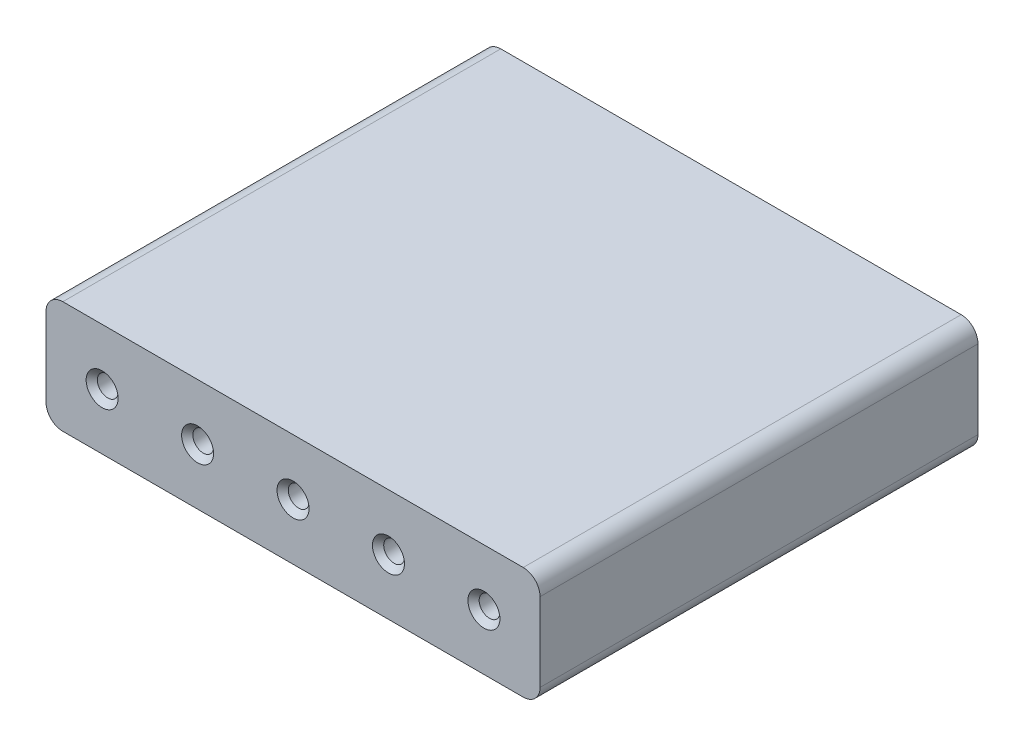
ISO-10303-21;
HEADER;
FILE_DESCRIPTION(('STEP AP214'),'2;1');
FILE_NAME('part.step','',(''),(''),'','','');
FILE_SCHEMA(('AUTOMOTIVE_DESIGN { 1 0 10303 214 1 1 1 1 }'));
ENDSEC;
DATA;
#1=APPLICATION_CONTEXT('core data for automotive mechanical design processes');
#2=APPLICATION_PROTOCOL_DEFINITION('international standard','automotive_design',2000,#1);
#3=PRODUCT_CONTEXT('',#1,'mechanical');
#4=PRODUCT('Part','Part','',(#3));
#5=PRODUCT_RELATED_PRODUCT_CATEGORY('part','',(#4));
#6=PRODUCT_DEFINITION_FORMATION('','',#4);
#7=PRODUCT_DEFINITION_CONTEXT('part definition',#1,'design');
#8=PRODUCT_DEFINITION('design','',#6,#7);
#9=PRODUCT_DEFINITION_SHAPE('','',#8);
#10=(LENGTH_UNIT() NAMED_UNIT(*) SI_UNIT(.MILLI.,.METRE.));
#11=(NAMED_UNIT(*) PLANE_ANGLE_UNIT() SI_UNIT($,.RADIAN.));
#12=(NAMED_UNIT(*) SI_UNIT($,.STERADIAN.) SOLID_ANGLE_UNIT());
#13=UNCERTAINTY_MEASURE_WITH_UNIT(LENGTH_MEASURE(1.E-05),#10,'distance_accuracy_value','');
#14=(GEOMETRIC_REPRESENTATION_CONTEXT(3) GLOBAL_UNCERTAINTY_ASSIGNED_CONTEXT((#13)) GLOBAL_UNIT_ASSIGNED_CONTEXT((#10,
#11,#12)) REPRESENTATION_CONTEXT('',''));
#15=CARTESIAN_POINT('',(0.,0.,0.));
#16=DIRECTION('',(0.,0.,1.));
#17=DIRECTION('',(1.,0.,0.));
#18=AXIS2_PLACEMENT_3D('',#15,#16,#17);
#19=CARTESIAN_POINT('',(41.,7.,78.));
#20=DIRECTION('',(0.,0.,1.));
#21=DIRECTION('',(1.,0.,0.));
#22=AXIS2_PLACEMENT_3D('',#19,#20,#21);
#23=PLANE('',#22);
#24=CARTESIAN_POINT('',(34.,0.,78.));
#25=DIRECTION('',(0.,0.,1.));
#26=DIRECTION('',(1.,0.,0.));
#27=AXIS2_PLACEMENT_3D('',#24,#25,#26);
#28=CIRCLE('',#27,2.84999999999999);
#29=CARTESIAN_POINT('',(36.85,0.,78.));
#30=VERTEX_POINT('',#29);
#31=EDGE_CURVE('E11',#30,#30,#28,.F.);
#32=ORIENTED_EDGE('',*,*,#31,.T.);
#33=EDGE_LOOP('',(#32));
#34=FACE_BOUND('',#33,.T.);
#35=CARTESIAN_POINT('',(0.,0.,78.));
#36=DIRECTION('',(0.,0.,1.));
#37=DIRECTION('',(1.,0.,0.));
#38=AXIS2_PLACEMENT_3D('',#35,#36,#37);
#39=CIRCLE('',#38,2.84999999999999);
#40=CARTESIAN_POINT('',(2.84999999999999,0.,78.));
#41=VERTEX_POINT('',#40);
#42=EDGE_CURVE('E51',#41,#41,#39,.F.);
#43=ORIENTED_EDGE('',*,*,#42,.T.);
#44=EDGE_LOOP('',(#43));
#45=FACE_BOUND('',#44,.T.);
#46=CARTESIAN_POINT('',(-17.,0.,78.));
#47=DIRECTION('',(0.,0.,1.));
#48=DIRECTION('',(1.,0.,0.));
#49=AXIS2_PLACEMENT_3D('',#46,#47,#48);
#50=CIRCLE('',#49,2.84999999999999);
#51=CARTESIAN_POINT('',(-14.15,0.,78.));
#52=VERTEX_POINT('',#51);
#53=EDGE_CURVE('E219',#52,#52,#50,.F.);
#54=ORIENTED_EDGE('',*,*,#53,.T.);
#55=EDGE_LOOP('',(#54));
#56=FACE_BOUND('',#55,.T.);
#57=CARTESIAN_POINT('',(17.,0.,78.));
#58=DIRECTION('',(0.,0.,1.));
#59=DIRECTION('',(1.,0.,0.));
#60=AXIS2_PLACEMENT_3D('',#57,#58,#59);
#61=CIRCLE('',#60,2.84999999999999);
#62=CARTESIAN_POINT('',(19.85,0.,78.));
#63=VERTEX_POINT('',#62);
#64=EDGE_CURVE('E216',#63,#63,#61,.F.);
#65=ORIENTED_EDGE('',*,*,#64,.T.);
#66=EDGE_LOOP('',(#65));
#67=FACE_BOUND('',#66,.T.);
#68=CARTESIAN_POINT('',(-34.,0.,78.));
#69=DIRECTION('',(0.,0.,1.));
#70=DIRECTION('',(1.,0.,0.));
#71=AXIS2_PLACEMENT_3D('',#68,#69,#70);
#72=CIRCLE('',#71,2.84999999999999);
#73=CARTESIAN_POINT('',(-31.15,0.,78.));
#74=VERTEX_POINT('',#73);
#75=EDGE_CURVE('E213',#74,#74,#72,.F.);
#76=ORIENTED_EDGE('',*,*,#75,.T.);
#77=EDGE_LOOP('',(#76));
#78=FACE_BOUND('',#77,.T.);
#79=CARTESIAN_POINT('',(41.,7.,78.));
#80=DIRECTION('',(0.,0.,1.));
#81=DIRECTION('',(1.,0.,0.));
#82=AXIS2_PLACEMENT_3D('',#79,#80,#81);
#83=CIRCLE('',#82,3.);
#84=CARTESIAN_POINT('',(44.,7.,78.));
#85=VERTEX_POINT('',#84);
#86=CARTESIAN_POINT('',(41.,10.,78.));
#87=VERTEX_POINT('',#86);
#88=EDGE_CURVE('E153',#85,#87,#83,.T.);
#89=ORIENTED_EDGE('',*,*,#88,.T.);
#90=DIRECTION('',(-1.,0.,0.));
#91=VECTOR('',#90,1.);
#92=CARTESIAN_POINT('',(41.,10.,78.));
#93=LINE('',#92,#91);
#94=CARTESIAN_POINT('',(-41.,10.,78.));
#95=VERTEX_POINT('',#94);
#96=EDGE_CURVE('E103',#87,#95,#93,.T.);
#97=ORIENTED_EDGE('',*,*,#96,.T.);
#98=CARTESIAN_POINT('',(-41.,7.,78.));
#99=DIRECTION('',(0.,0.,1.));
#100=DIRECTION('',(1.,0.,0.));
#101=AXIS2_PLACEMENT_3D('',#98,#99,#100);
#102=CIRCLE('',#101,3.);
#103=CARTESIAN_POINT('',(-44.,7.,78.));
#104=VERTEX_POINT('',#103);
#105=EDGE_CURVE('E372',#95,#104,#102,.T.);
#106=ORIENTED_EDGE('',*,*,#105,.T.);
#107=DIRECTION('',(0.,-1.,0.));
#108=VECTOR('',#107,1.);
#109=CARTESIAN_POINT('',(-44.,-7.,78.));
#110=LINE('',#109,#108);
#111=CARTESIAN_POINT('',(-44.,-7.,78.));
#112=VERTEX_POINT('',#111);
#113=EDGE_CURVE('E376',#104,#112,#110,.T.);
#114=ORIENTED_EDGE('',*,*,#113,.T.);
#115=CARTESIAN_POINT('',(-41.,-7.,78.));
#116=DIRECTION('',(0.,0.,1.));
#117=DIRECTION('',(-1.,0.,0.));
#118=AXIS2_PLACEMENT_3D('',#115,#116,#117);
#119=CIRCLE('',#118,3.00000000000001);
#120=CARTESIAN_POINT('',(-41.,-10.,78.));
#121=VERTEX_POINT('',#120);
#122=EDGE_CURVE('E121',#112,#121,#119,.T.);
#123=ORIENTED_EDGE('',*,*,#122,.T.);
#124=DIRECTION('',(1.,0.,0.));
#125=VECTOR('',#124,1.);
#126=CARTESIAN_POINT('',(41.,-10.,78.));
#127=LINE('',#126,#125);
#128=CARTESIAN_POINT('',(41.,-10.,78.));
#129=VERTEX_POINT('',#128);
#130=EDGE_CURVE('E116',#121,#129,#127,.T.);
#131=ORIENTED_EDGE('',*,*,#130,.T.);
#132=CARTESIAN_POINT('',(41.,-7.,78.));
#133=DIRECTION('',(0.,0.,1.));
#134=DIRECTION('',(1.,0.,0.));
#135=AXIS2_PLACEMENT_3D('',#132,#133,#134);
#136=CIRCLE('',#135,3.);
#137=CARTESIAN_POINT('',(44.,-7.,78.));
#138=VERTEX_POINT('',#137);
#139=EDGE_CURVE('E119',#129,#138,#136,.T.);
#140=ORIENTED_EDGE('',*,*,#139,.T.);
#141=DIRECTION('',(0.,1.,0.));
#142=VECTOR('',#141,1.);
#143=CARTESIAN_POINT('',(44.,-7.,78.));
#144=LINE('',#143,#142);
#145=EDGE_CURVE('E59',#138,#85,#144,.T.);
#146=ORIENTED_EDGE('',*,*,#145,.T.);
#147=EDGE_LOOP('',(#89,#97,#106,#114,#123,#131,#140,#146));
#148=FACE_BOUND('',#147,.T.);
#149=ADVANCED_FACE('F41',(#34,#45,#56,#67,#78,#148),#23,.T.);
#150=CARTESIAN_POINT('',(41.,7.,0.));
#151=DIRECTION('',(0.,0.,1.));
#152=DIRECTION('',(1.,0.,0.));
#153=AXIS2_PLACEMENT_3D('',#150,#151,#152);
#154=PLANE('',#153);
#155=CARTESIAN_POINT('',(17.,0.,0.));
#156=DIRECTION('',(0.,0.,1.));
#157=DIRECTION('',(1.,0.,0.));
#158=AXIS2_PLACEMENT_3D('',#155,#156,#157);
#159=CIRCLE('',#158,2.85000000000002);
#160=CARTESIAN_POINT('',(19.85,0.,0.));
#161=VERTEX_POINT('',#160);
#162=EDGE_CURVE('E180',#161,#161,#159,.T.);
#163=ORIENTED_EDGE('',*,*,#162,.T.);
#164=EDGE_LOOP('',(#163));
#165=FACE_BOUND('',#164,.T.);
#166=CARTESIAN_POINT('',(0.,0.,0.));
#167=DIRECTION('',(0.,0.,1.));
#168=DIRECTION('',(1.,0.,0.));
#169=AXIS2_PLACEMENT_3D('',#166,#167,#168);
#170=CIRCLE('',#169,2.85000000000002);
#171=CARTESIAN_POINT('',(2.85000000000002,0.,0.));
#172=VERTEX_POINT('',#171);
#173=EDGE_CURVE('E177',#172,#172,#170,.T.);
#174=ORIENTED_EDGE('',*,*,#173,.T.);
#175=EDGE_LOOP('',(#174));
#176=FACE_BOUND('',#175,.T.);
#177=CARTESIAN_POINT('',(-17.,0.,0.));
#178=DIRECTION('',(0.,0.,1.));
#179=DIRECTION('',(1.,0.,0.));
#180=AXIS2_PLACEMENT_3D('',#177,#178,#179);
#181=CIRCLE('',#180,2.85000000000002);
#182=CARTESIAN_POINT('',(-14.15,0.,0.));
#183=VERTEX_POINT('',#182);
#184=EDGE_CURVE('E174',#183,#183,#181,.T.);
#185=ORIENTED_EDGE('',*,*,#184,.T.);
#186=EDGE_LOOP('',(#185));
#187=FACE_BOUND('',#186,.T.);
#188=CARTESIAN_POINT('',(-34.,0.,0.));
#189=DIRECTION('',(0.,0.,1.));
#190=DIRECTION('',(1.,0.,0.));
#191=AXIS2_PLACEMENT_3D('',#188,#189,#190);
#192=CIRCLE('',#191,2.84999999999999);
#193=CARTESIAN_POINT('',(-31.15,0.,0.));
#194=VERTEX_POINT('',#193);
#195=EDGE_CURVE('E171',#194,#194,#192,.T.);
#196=ORIENTED_EDGE('',*,*,#195,.T.);
#197=EDGE_LOOP('',(#196));
#198=FACE_BOUND('',#197,.T.);
#199=CARTESIAN_POINT('',(34.,0.,0.));
#200=DIRECTION('',(0.,0.,1.));
#201=DIRECTION('',(1.,0.,0.));
#202=AXIS2_PLACEMENT_3D('',#199,#200,#201);
#203=CIRCLE('',#202,2.84999999999999);
#204=CARTESIAN_POINT('',(36.85,0.,0.));
#205=VERTEX_POINT('',#204);
#206=EDGE_CURVE('E168',#205,#205,#203,.T.);
#207=ORIENTED_EDGE('',*,*,#206,.T.);
#208=EDGE_LOOP('',(#207));
#209=FACE_BOUND('',#208,.T.);
#210=CARTESIAN_POINT('',(41.,7.,0.));
#211=DIRECTION('',(0.,0.,1.));
#212=DIRECTION('',(1.,0.,0.));
#213=AXIS2_PLACEMENT_3D('',#210,#211,#212);
#214=CIRCLE('',#213,3.);
#215=CARTESIAN_POINT('',(44.,7.,0.));
#216=VERTEX_POINT('',#215);
#217=CARTESIAN_POINT('',(41.,10.,0.));
#218=VERTEX_POINT('',#217);
#219=EDGE_CURVE('E139',#216,#218,#214,.T.);
#220=ORIENTED_EDGE('',*,*,#219,.F.);
#221=DIRECTION('',(0.,1.,0.));
#222=VECTOR('',#221,1.);
#223=CARTESIAN_POINT('',(44.,-7.,0.));
#224=LINE('',#223,#222);
#225=CARTESIAN_POINT('',(44.,-7.,0.));
#226=VERTEX_POINT('',#225);
#227=EDGE_CURVE('E94',#226,#216,#224,.T.);
#228=ORIENTED_EDGE('',*,*,#227,.F.);
#229=CARTESIAN_POINT('',(41.,-7.,0.));
#230=DIRECTION('',(0.,0.,1.));
#231=DIRECTION('',(1.,0.,0.));
#232=AXIS2_PLACEMENT_3D('',#229,#230,#231);
#233=CIRCLE('',#232,3.);
#234=CARTESIAN_POINT('',(41.,-10.,0.));
#235=VERTEX_POINT('',#234);
#236=EDGE_CURVE('E88',#235,#226,#233,.T.);
#237=ORIENTED_EDGE('',*,*,#236,.F.);
#238=DIRECTION('',(1.,0.,0.));
#239=VECTOR('',#238,1.);
#240=CARTESIAN_POINT('',(41.,-10.,0.));
#241=LINE('',#240,#239);
#242=CARTESIAN_POINT('',(-41.,-10.,0.));
#243=VERTEX_POINT('',#242);
#244=EDGE_CURVE('E129',#243,#235,#241,.T.);
#245=ORIENTED_EDGE('',*,*,#244,.F.);
#246=CARTESIAN_POINT('',(-41.,-7.,0.));
#247=DIRECTION('',(0.,0.,1.));
#248=DIRECTION('',(-1.,0.,0.));
#249=AXIS2_PLACEMENT_3D('',#246,#247,#248);
#250=CIRCLE('',#249,3.00000000000001);
#251=CARTESIAN_POINT('',(-44.,-7.,0.));
#252=VERTEX_POINT('',#251);
#253=EDGE_CURVE('E148',#252,#243,#250,.T.);
#254=ORIENTED_EDGE('',*,*,#253,.F.);
#255=DIRECTION('',(0.,-1.,0.));
#256=VECTOR('',#255,1.);
#257=CARTESIAN_POINT('',(-44.,-7.,0.));
#258=LINE('',#257,#256);
#259=CARTESIAN_POINT('',(-44.,7.,0.));
#260=VERTEX_POINT('',#259);
#261=EDGE_CURVE('E146',#260,#252,#258,.T.);
#262=ORIENTED_EDGE('',*,*,#261,.F.);
#263=CARTESIAN_POINT('',(-41.,7.,0.));
#264=DIRECTION('',(0.,0.,1.));
#265=DIRECTION('',(1.,0.,0.));
#266=AXIS2_PLACEMENT_3D('',#263,#264,#265);
#267=CIRCLE('',#266,3.);
#268=CARTESIAN_POINT('',(-41.,10.,0.));
#269=VERTEX_POINT('',#268);
#270=EDGE_CURVE('E144',#269,#260,#267,.T.);
#271=ORIENTED_EDGE('',*,*,#270,.F.);
#272=DIRECTION('',(-1.,0.,0.));
#273=VECTOR('',#272,1.);
#274=CARTESIAN_POINT('',(41.,10.,0.));
#275=LINE('',#274,#273);
#276=EDGE_CURVE('E142',#218,#269,#275,.T.);
#277=ORIENTED_EDGE('',*,*,#276,.F.);
#278=EDGE_LOOP('',(#220,#228,#237,#245,#254,#262,#271,#277));
#279=FACE_BOUND('',#278,.T.);
#280=ADVANCED_FACE('F251',(#165,#176,#187,#198,#209,#279),#154,.F.);
#281=CARTESIAN_POINT('',(41.,7.,78.));
#282=DIRECTION('',(0.,0.,-1.));
#283=DIRECTION('',(-1.,0.,0.));
#284=AXIS2_PLACEMENT_3D('',#281,#282,#283);
#285=CYLINDRICAL_SURFACE('',#284,3.);
#286=ORIENTED_EDGE('',*,*,#219,.T.);
#287=DIRECTION('',(0.,0.,-1.));
#288=VECTOR('',#287,1.);
#289=CARTESIAN_POINT('',(41.,10.,78.));
#290=LINE('',#289,#288);
#291=EDGE_CURVE('E166',#87,#218,#290,.T.);
#292=ORIENTED_EDGE('',*,*,#291,.F.);
#293=ORIENTED_EDGE('',*,*,#88,.F.);
#294=DIRECTION('',(0.,0.,-1.));
#295=VECTOR('',#294,1.);
#296=CARTESIAN_POINT('',(44.,7.,78.));
#297=LINE('',#296,#295);
#298=EDGE_CURVE('E135',#85,#216,#297,.T.);
#299=ORIENTED_EDGE('',*,*,#298,.T.);
#300=EDGE_LOOP('',(#286,#292,#293,#299));
#301=FACE_BOUND('',#300,.T.);
#302=ADVANCED_FACE('F258',(#301),#285,.T.);
#303=CARTESIAN_POINT('',(41.,10.,78.));
#304=DIRECTION('',(0.,-1.,0.));
#305=DIRECTION('',(1.,0.,0.));
#306=AXIS2_PLACEMENT_3D('',#303,#304,#305);
#307=PLANE('',#306);
#308=ORIENTED_EDGE('',*,*,#276,.T.);
#309=DIRECTION('',(0.,0.,-1.));
#310=VECTOR('',#309,1.);
#311=CARTESIAN_POINT('',(-41.,10.,78.));
#312=LINE('',#311,#310);
#313=EDGE_CURVE('E163',#95,#269,#312,.T.);
#314=ORIENTED_EDGE('',*,*,#313,.F.);
#315=ORIENTED_EDGE('',*,*,#96,.F.);
#316=ORIENTED_EDGE('',*,*,#291,.T.);
#317=EDGE_LOOP('',(#308,#314,#315,#316));
#318=FACE_BOUND('',#317,.T.);
#319=ADVANCED_FACE('F280',(#318),#307,.F.);
#320=CARTESIAN_POINT('',(-41.,7.,78.));
#321=DIRECTION('',(0.,0.,-1.));
#322=DIRECTION('',(-1.,0.,0.));
#323=AXIS2_PLACEMENT_3D('',#320,#321,#322);
#324=CYLINDRICAL_SURFACE('',#323,3.);
#325=ORIENTED_EDGE('',*,*,#270,.T.);
#326=DIRECTION('',(0.,0.,-1.));
#327=VECTOR('',#326,1.);
#328=CARTESIAN_POINT('',(-44.,7.,78.));
#329=LINE('',#328,#327);
#330=EDGE_CURVE('E160',#104,#260,#329,.T.);
#331=ORIENTED_EDGE('',*,*,#330,.F.);
#332=ORIENTED_EDGE('',*,*,#105,.F.);
#333=ORIENTED_EDGE('',*,*,#313,.T.);
#334=EDGE_LOOP('',(#325,#331,#332,#333));
#335=FACE_BOUND('',#334,.T.);
#336=ADVANCED_FACE('F276',(#335),#324,.T.);
#337=CARTESIAN_POINT('',(-44.,-7.,78.));
#338=DIRECTION('',(1.,0.,0.));
#339=DIRECTION('',(0.,0.,-1.));
#340=AXIS2_PLACEMENT_3D('',#337,#338,#339);
#341=PLANE('',#340);
#342=ORIENTED_EDGE('',*,*,#261,.T.);
#343=DIRECTION('',(0.,0.,-1.));
#344=VECTOR('',#343,1.);
#345=CARTESIAN_POINT('',(-44.,-7.,78.));
#346=LINE('',#345,#344);
#347=EDGE_CURVE('E157',#112,#252,#346,.T.);
#348=ORIENTED_EDGE('',*,*,#347,.F.);
#349=ORIENTED_EDGE('',*,*,#113,.F.);
#350=ORIENTED_EDGE('',*,*,#330,.T.);
#351=EDGE_LOOP('',(#342,#348,#349,#350));
#352=FACE_BOUND('',#351,.T.);
#353=ADVANCED_FACE('F272',(#352),#341,.F.);
#354=CARTESIAN_POINT('',(-41.,-7.,78.));
#355=DIRECTION('',(0.,0.,-1.));
#356=DIRECTION('',(-1.,0.,0.));
#357=AXIS2_PLACEMENT_3D('',#354,#355,#356);
#358=CYLINDRICAL_SURFACE('',#357,3.00000000000001);
#359=ORIENTED_EDGE('',*,*,#253,.T.);
#360=DIRECTION('',(0.,0.,-1.));
#361=VECTOR('',#360,1.);
#362=CARTESIAN_POINT('',(-41.,-10.,78.));
#363=LINE('',#362,#361);
#364=EDGE_CURVE('E130',#121,#243,#363,.T.);
#365=ORIENTED_EDGE('',*,*,#364,.F.);
#366=ORIENTED_EDGE('',*,*,#122,.F.);
#367=ORIENTED_EDGE('',*,*,#347,.T.);
#368=EDGE_LOOP('',(#359,#365,#366,#367));
#369=FACE_BOUND('',#368,.T.);
#370=ADVANCED_FACE('F269',(#369),#358,.T.);
#371=CARTESIAN_POINT('',(41.,-10.,78.));
#372=DIRECTION('',(0.,1.,0.));
#373=DIRECTION('',(-1.,0.,0.));
#374=AXIS2_PLACEMENT_3D('',#371,#372,#373);
#375=PLANE('',#374);
#376=ORIENTED_EDGE('',*,*,#244,.T.);
#377=DIRECTION('',(0.,0.,-1.));
#378=VECTOR('',#377,1.);
#379=CARTESIAN_POINT('',(41.,-10.,78.));
#380=LINE('',#379,#378);
#381=EDGE_CURVE('E126',#129,#235,#380,.T.);
#382=ORIENTED_EDGE('',*,*,#381,.F.);
#383=ORIENTED_EDGE('',*,*,#130,.F.);
#384=ORIENTED_EDGE('',*,*,#364,.T.);
#385=EDGE_LOOP('',(#376,#382,#383,#384));
#386=FACE_BOUND('',#385,.T.);
#387=ADVANCED_FACE('F127',(#386),#375,.F.);
#388=CARTESIAN_POINT('',(41.,-7.,78.));
#389=DIRECTION('',(0.,0.,-1.));
#390=DIRECTION('',(-1.,0.,0.));
#391=AXIS2_PLACEMENT_3D('',#388,#389,#390);
#392=CYLINDRICAL_SURFACE('',#391,3.);
#393=ORIENTED_EDGE('',*,*,#236,.T.);
#394=DIRECTION('',(0.,0.,-1.));
#395=VECTOR('',#394,1.);
#396=CARTESIAN_POINT('',(44.,-7.,78.));
#397=LINE('',#396,#395);
#398=EDGE_CURVE('E131',#138,#226,#397,.T.);
#399=ORIENTED_EDGE('',*,*,#398,.F.);
#400=ORIENTED_EDGE('',*,*,#139,.F.);
#401=ORIENTED_EDGE('',*,*,#381,.T.);
#402=EDGE_LOOP('',(#393,#399,#400,#401));
#403=FACE_BOUND('',#402,.T.);
#404=ADVANCED_FACE('F133',(#403),#392,.T.);
#405=CARTESIAN_POINT('',(44.,-7.,78.));
#406=DIRECTION('',(-1.,0.,0.));
#407=DIRECTION('',(0.,0.,1.));
#408=AXIS2_PLACEMENT_3D('',#405,#406,#407);
#409=PLANE('',#408);
#410=ORIENTED_EDGE('',*,*,#227,.T.);
#411=ORIENTED_EDGE('',*,*,#298,.F.);
#412=ORIENTED_EDGE('',*,*,#145,.F.);
#413=ORIENTED_EDGE('',*,*,#398,.T.);
#414=EDGE_LOOP('',(#410,#411,#412,#413));
#415=FACE_BOUND('',#414,.T.);
#416=ADVANCED_FACE('F263',(#415),#409,.F.);
#417=CARTESIAN_POINT('',(-34.,0.,78.));
#418=DIRECTION('',(0.,0.,-1.));
#419=DIRECTION('',(-1.,0.,0.));
#420=AXIS2_PLACEMENT_3D('',#417,#418,#419);
#421=CYLINDRICAL_SURFACE('',#420,1.85);
#422=CARTESIAN_POINT('',(-34.,0.,1.00000000000001));
#423=DIRECTION('',(0.,0.,1.));
#424=DIRECTION('',(1.,0.,0.));
#425=AXIS2_PLACEMENT_3D('',#422,#423,#424);
#426=CIRCLE('',#425,1.85);
#427=CARTESIAN_POINT('',(-32.15,0.,1.00000000000001));
#428=VERTEX_POINT('',#427);
#429=EDGE_CURVE('E204',#428,#428,#426,.F.);
#430=ORIENTED_EDGE('',*,*,#429,.T.);
#431=EDGE_LOOP('',(#430));
#432=FACE_BOUND('',#431,.T.);
#433=CARTESIAN_POINT('',(-34.,0.,77.));
#434=DIRECTION('',(0.,0.,1.));
#435=DIRECTION('',(1.,0.,0.));
#436=AXIS2_PLACEMENT_3D('',#433,#434,#435);
#437=CIRCLE('',#436,1.85);
#438=CARTESIAN_POINT('',(-32.15,0.,77.));
#439=VERTEX_POINT('',#438);
#440=EDGE_CURVE('E201',#439,#439,#437,.T.);
#441=ORIENTED_EDGE('',*,*,#440,.T.);
#442=EDGE_LOOP('',(#441));
#443=FACE_BOUND('',#442,.T.);
#444=ADVANCED_FACE('F247',(#432,#443),#421,.F.);
#445=CARTESIAN_POINT('',(-17.,0.,78.));
#446=DIRECTION('',(0.,0.,-1.));
#447=DIRECTION('',(-1.,0.,0.));
#448=AXIS2_PLACEMENT_3D('',#445,#446,#447);
#449=CYLINDRICAL_SURFACE('',#448,1.85);
#450=CARTESIAN_POINT('',(-17.,0.,1.00000000000001));
#451=DIRECTION('',(0.,0.,1.));
#452=DIRECTION('',(1.,0.,0.));
#453=AXIS2_PLACEMENT_3D('',#450,#451,#452);
#454=CIRCLE('',#453,1.85);
#455=CARTESIAN_POINT('',(-15.15,0.,1.00000000000001));
#456=VERTEX_POINT('',#455);
#457=EDGE_CURVE('E198',#456,#456,#454,.F.);
#458=ORIENTED_EDGE('',*,*,#457,.T.);
#459=EDGE_LOOP('',(#458));
#460=FACE_BOUND('',#459,.T.);
#461=CARTESIAN_POINT('',(-17.,0.,77.));
#462=DIRECTION('',(0.,0.,1.));
#463=DIRECTION('',(1.,0.,0.));
#464=AXIS2_PLACEMENT_3D('',#461,#462,#463);
#465=CIRCLE('',#464,1.85);
#466=CARTESIAN_POINT('',(-15.15,0.,77.));
#467=VERTEX_POINT('',#466);
#468=EDGE_CURVE('E195',#467,#467,#465,.T.);
#469=ORIENTED_EDGE('',*,*,#468,.T.);
#470=EDGE_LOOP('',(#469));
#471=FACE_BOUND('',#470,.T.);
#472=ADVANCED_FACE('F237',(#460,#471),#449,.F.);
#473=CARTESIAN_POINT('',(0.,0.,78.));
#474=DIRECTION('',(0.,0.,-1.));
#475=DIRECTION('',(-1.,0.,0.));
#476=AXIS2_PLACEMENT_3D('',#473,#474,#475);
#477=CYLINDRICAL_SURFACE('',#476,1.85);
#478=CARTESIAN_POINT('',(0.,0.,1.00000000000001));
#479=DIRECTION('',(0.,0.,1.));
#480=DIRECTION('',(1.,0.,0.));
#481=AXIS2_PLACEMENT_3D('',#478,#479,#480);
#482=CIRCLE('',#481,1.85);
#483=CARTESIAN_POINT('',(1.85,0.,1.00000000000001));
#484=VERTEX_POINT('',#483);
#485=EDGE_CURVE('E192',#484,#484,#482,.F.);
#486=ORIENTED_EDGE('',*,*,#485,.T.);
#487=EDGE_LOOP('',(#486));
#488=FACE_BOUND('',#487,.T.);
#489=CARTESIAN_POINT('',(0.,0.,77.));
#490=DIRECTION('',(0.,0.,1.));
#491=DIRECTION('',(1.,0.,0.));
#492=AXIS2_PLACEMENT_3D('',#489,#490,#491);
#493=CIRCLE('',#492,1.85);
#494=CARTESIAN_POINT('',(1.85,0.,77.));
#495=VERTEX_POINT('',#494);
#496=EDGE_CURVE('E189',#495,#495,#493,.T.);
#497=ORIENTED_EDGE('',*,*,#496,.T.);
#498=EDGE_LOOP('',(#497));
#499=FACE_BOUND('',#498,.T.);
#500=ADVANCED_FACE('F234',(#488,#499),#477,.F.);
#501=CARTESIAN_POINT('',(17.,0.,78.));
#502=DIRECTION('',(0.,0.,-1.));
#503=DIRECTION('',(-1.,0.,0.));
#504=AXIS2_PLACEMENT_3D('',#501,#502,#503);
#505=CYLINDRICAL_SURFACE('',#504,1.85);
#506=CARTESIAN_POINT('',(17.,0.,1.00000000000001));
#507=DIRECTION('',(0.,0.,1.));
#508=DIRECTION('',(1.,0.,0.));
#509=AXIS2_PLACEMENT_3D('',#506,#507,#508);
#510=CIRCLE('',#509,1.85);
#511=CARTESIAN_POINT('',(18.85,0.,1.00000000000001));
#512=VERTEX_POINT('',#511);
#513=EDGE_CURVE('E186',#512,#512,#510,.F.);
#514=ORIENTED_EDGE('',*,*,#513,.T.);
#515=EDGE_LOOP('',(#514));
#516=FACE_BOUND('',#515,.T.);
#517=CARTESIAN_POINT('',(17.,0.,77.));
#518=DIRECTION('',(0.,0.,1.));
#519=DIRECTION('',(1.,0.,0.));
#520=AXIS2_PLACEMENT_3D('',#517,#518,#519);
#521=CIRCLE('',#520,1.85);
#522=CARTESIAN_POINT('',(18.85,0.,77.));
#523=VERTEX_POINT('',#522);
#524=EDGE_CURVE('E183',#523,#523,#521,.T.);
#525=ORIENTED_EDGE('',*,*,#524,.T.);
#526=EDGE_LOOP('',(#525));
#527=FACE_BOUND('',#526,.T.);
#528=ADVANCED_FACE('F236',(#516,#527),#505,.F.);
#529=CARTESIAN_POINT('',(34.,0.,78.));
#530=DIRECTION('',(0.,0.,-1.));
#531=DIRECTION('',(-1.,0.,0.));
#532=AXIS2_PLACEMENT_3D('',#529,#530,#531);
#533=CYLINDRICAL_SURFACE('',#532,1.85);
#534=CARTESIAN_POINT('',(34.,0.,1.00000000000001));
#535=DIRECTION('',(0.,0.,1.));
#536=DIRECTION('',(1.,0.,0.));
#537=AXIS2_PLACEMENT_3D('',#534,#535,#536);
#538=CIRCLE('',#537,1.85);
#539=CARTESIAN_POINT('',(35.85,0.,1.00000000000001));
#540=VERTEX_POINT('',#539);
#541=EDGE_CURVE('E210',#540,#540,#538,.F.);
#542=ORIENTED_EDGE('',*,*,#541,.T.);
#543=EDGE_LOOP('',(#542));
#544=FACE_BOUND('',#543,.T.);
#545=CARTESIAN_POINT('',(34.,0.,77.));
#546=DIRECTION('',(0.,0.,1.));
#547=DIRECTION('',(1.,0.,0.));
#548=AXIS2_PLACEMENT_3D('',#545,#546,#547);
#549=CIRCLE('',#548,1.85);
#550=CARTESIAN_POINT('',(35.85,0.,77.));
#551=VERTEX_POINT('',#550);
#552=EDGE_CURVE('E207',#551,#551,#549,.T.);
#553=ORIENTED_EDGE('',*,*,#552,.T.);
#554=EDGE_LOOP('',(#553));
#555=FACE_BOUND('',#554,.T.);
#556=ADVANCED_FACE('F244',(#544,#555),#533,.F.);
#557=CARTESIAN_POINT('',(17.,0.,0.));
#558=DIRECTION('',(0.,0.,-1.));
#559=DIRECTION('',(-1.,0.,0.));
#560=AXIS2_PLACEMENT_3D('',#557,#558,#559);
#561=CONICAL_SURFACE('',#560,2.85000000000002,0.78539816339745);
#562=ORIENTED_EDGE('',*,*,#513,.F.);
#563=EDGE_LOOP('',(#562));
#564=FACE_BOUND('',#563,.T.);
#565=ORIENTED_EDGE('',*,*,#162,.F.);
#566=EDGE_LOOP('',(#565));
#567=FACE_BOUND('',#566,.T.);
#568=ADVANCED_FACE('F288',(#564,#567),#561,.F.);
#569=CARTESIAN_POINT('',(0.,0.,0.));
#570=DIRECTION('',(0.,0.,-1.));
#571=DIRECTION('',(-1.,0.,0.));
#572=AXIS2_PLACEMENT_3D('',#569,#570,#571);
#573=CONICAL_SURFACE('',#572,2.85000000000002,0.78539816339745);
#574=ORIENTED_EDGE('',*,*,#485,.F.);
#575=EDGE_LOOP('',(#574));
#576=FACE_BOUND('',#575,.T.);
#577=ORIENTED_EDGE('',*,*,#173,.F.);
#578=EDGE_LOOP('',(#577));
#579=FACE_BOUND('',#578,.T.);
#580=ADVANCED_FACE('F294',(#576,#579),#573,.F.);
#581=CARTESIAN_POINT('',(-17.,0.,0.));
#582=DIRECTION('',(0.,0.,-1.));
#583=DIRECTION('',(-1.,0.,0.));
#584=AXIS2_PLACEMENT_3D('',#581,#582,#583);
#585=CONICAL_SURFACE('',#584,2.85000000000002,0.78539816339745);
#586=ORIENTED_EDGE('',*,*,#457,.F.);
#587=EDGE_LOOP('',(#586));
#588=FACE_BOUND('',#587,.T.);
#589=ORIENTED_EDGE('',*,*,#184,.F.);
#590=EDGE_LOOP('',(#589));
#591=FACE_BOUND('',#590,.T.);
#592=ADVANCED_FACE('F301',(#588,#591),#585,.F.);
#593=CARTESIAN_POINT('',(-34.,0.,0.));
#594=DIRECTION('',(0.,0.,-1.));
#595=DIRECTION('',(-1.,0.,0.));
#596=AXIS2_PLACEMENT_3D('',#593,#594,#595);
#597=CONICAL_SURFACE('',#596,2.84999999999999,0.785398163397438);
#598=ORIENTED_EDGE('',*,*,#429,.F.);
#599=EDGE_LOOP('',(#598));
#600=FACE_BOUND('',#599,.T.);
#601=ORIENTED_EDGE('',*,*,#195,.F.);
#602=EDGE_LOOP('',(#601));
#603=FACE_BOUND('',#602,.T.);
#604=ADVANCED_FACE('F308',(#600,#603),#597,.F.);
#605=CARTESIAN_POINT('',(34.,0.,0.));
#606=DIRECTION('',(0.,0.,-1.));
#607=DIRECTION('',(-1.,0.,0.));
#608=AXIS2_PLACEMENT_3D('',#605,#606,#607);
#609=CONICAL_SURFACE('',#608,2.84999999999999,0.785398163397438);
#610=ORIENTED_EDGE('',*,*,#541,.F.);
#611=EDGE_LOOP('',(#610));
#612=FACE_BOUND('',#611,.T.);
#613=ORIENTED_EDGE('',*,*,#206,.F.);
#614=EDGE_LOOP('',(#613));
#615=FACE_BOUND('',#614,.T.);
#616=ADVANCED_FACE('F315',(#612,#615),#609,.F.);
#617=CARTESIAN_POINT('',(34.,0.,77.));
#618=DIRECTION('',(0.,0.,1.));
#619=DIRECTION('',(1.,0.,0.));
#620=AXIS2_PLACEMENT_3D('',#617,#618,#619);
#621=CONICAL_SURFACE('',#620,1.85,0.785398163397445);
#622=ORIENTED_EDGE('',*,*,#31,.F.);
#623=EDGE_LOOP('',(#622));
#624=FACE_BOUND('',#623,.T.);
#625=ORIENTED_EDGE('',*,*,#552,.F.);
#626=EDGE_LOOP('',(#625));
#627=FACE_BOUND('',#626,.T.);
#628=ADVANCED_FACE('F230',(#624,#627),#621,.F.);
#629=CARTESIAN_POINT('',(0.,0.,77.));
#630=DIRECTION('',(0.,0.,1.));
#631=DIRECTION('',(1.,0.,0.));
#632=AXIS2_PLACEMENT_3D('',#629,#630,#631);
#633=CONICAL_SURFACE('',#632,1.85,0.785398163397444);
#634=ORIENTED_EDGE('',*,*,#42,.F.);
#635=EDGE_LOOP('',(#634));
#636=FACE_BOUND('',#635,.T.);
#637=ORIENTED_EDGE('',*,*,#496,.F.);
#638=EDGE_LOOP('',(#637));
#639=FACE_BOUND('',#638,.T.);
#640=ADVANCED_FACE('F226',(#636,#639),#633,.F.);
#641=CARTESIAN_POINT('',(-17.,0.,77.));
#642=DIRECTION('',(0.,0.,1.));
#643=DIRECTION('',(1.,0.,0.));
#644=AXIS2_PLACEMENT_3D('',#641,#642,#643);
#645=CONICAL_SURFACE('',#644,1.85,0.785398163397443);
#646=ORIENTED_EDGE('',*,*,#53,.F.);
#647=EDGE_LOOP('',(#646));
#648=FACE_BOUND('',#647,.T.);
#649=ORIENTED_EDGE('',*,*,#468,.F.);
#650=EDGE_LOOP('',(#649));
#651=FACE_BOUND('',#650,.T.);
#652=ADVANCED_FACE('F229',(#648,#651),#645,.F.);
#653=CARTESIAN_POINT('',(17.,0.,77.));
#654=DIRECTION('',(0.,0.,1.));
#655=DIRECTION('',(1.,0.,0.));
#656=AXIS2_PLACEMENT_3D('',#653,#654,#655);
#657=CONICAL_SURFACE('',#656,1.85,0.785398163397443);
#658=ORIENTED_EDGE('',*,*,#64,.F.);
#659=EDGE_LOOP('',(#658));
#660=FACE_BOUND('',#659,.T.);
#661=ORIENTED_EDGE('',*,*,#524,.F.);
#662=EDGE_LOOP('',(#661));
#663=FACE_BOUND('',#662,.T.);
#664=ADVANCED_FACE('F336',(#660,#663),#657,.F.);
#665=CARTESIAN_POINT('',(-34.,0.,77.));
#666=DIRECTION('',(0.,0.,1.));
#667=DIRECTION('',(1.,0.,0.));
#668=AXIS2_PLACEMENT_3D('',#665,#666,#667);
#669=CONICAL_SURFACE('',#668,1.85,0.785398163397445);
#670=ORIENTED_EDGE('',*,*,#75,.F.);
#671=EDGE_LOOP('',(#670));
#672=FACE_BOUND('',#671,.T.);
#673=ORIENTED_EDGE('',*,*,#440,.F.);
#674=EDGE_LOOP('',(#673));
#675=FACE_BOUND('',#674,.T.);
#676=ADVANCED_FACE('F44',(#672,#675),#669,.F.);
#677=CLOSED_SHELL('',(#149,#280,#302,#319,#336,#353,#370,#387,#404,#416,#444,#472,#500,#528,
#556,#568,#580,#592,#604,#616,#628,#640,#652,#664,#676));
#678=MANIFOLD_SOLID_BREP('B2',#677);
#679=ADVANCED_BREP_SHAPE_REPRESENTATION('',(#18,#678),#14);
#680=SHAPE_DEFINITION_REPRESENTATION(#9,#679);
ENDSEC;
END-ISO-10303-21;
